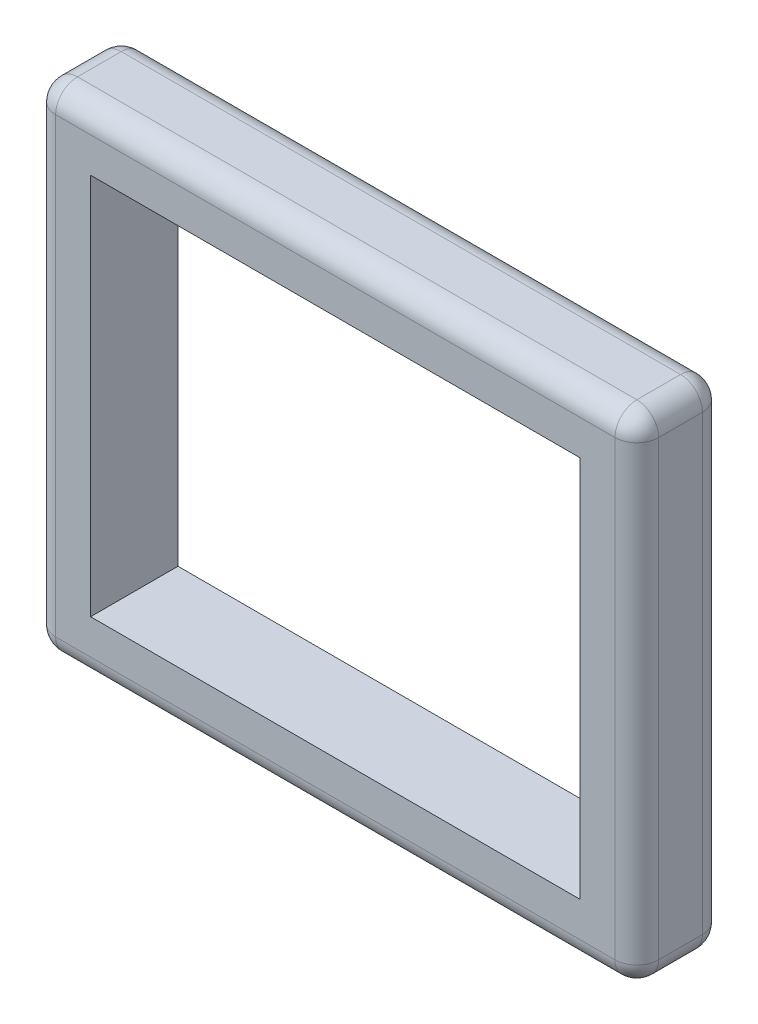
ISO-10303-21;
HEADER;
FILE_DESCRIPTION(('STEP AP214'),'2;1');
FILE_NAME('part.step','',(''),(''),'','','');
FILE_SCHEMA(('AUTOMOTIVE_DESIGN { 1 0 10303 214 1 1 1 1 }'));
ENDSEC;
DATA;
#1=APPLICATION_CONTEXT('core data for automotive mechanical design processes');
#2=APPLICATION_PROTOCOL_DEFINITION('international standard','automotive_design',2000,#1);
#3=PRODUCT_CONTEXT('',#1,'mechanical');
#4=PRODUCT('Part','Part','',(#3));
#5=PRODUCT_RELATED_PRODUCT_CATEGORY('part','',(#4));
#6=PRODUCT_DEFINITION_FORMATION('','',#4);
#7=PRODUCT_DEFINITION_CONTEXT('part definition',#1,'design');
#8=PRODUCT_DEFINITION('design','',#6,#7);
#9=PRODUCT_DEFINITION_SHAPE('','',#8);
#10=(LENGTH_UNIT() NAMED_UNIT(*) SI_UNIT(.MILLI.,.METRE.));
#11=(NAMED_UNIT(*) PLANE_ANGLE_UNIT() SI_UNIT($,.RADIAN.));
#12=(NAMED_UNIT(*) SI_UNIT($,.STERADIAN.) SOLID_ANGLE_UNIT());
#13=UNCERTAINTY_MEASURE_WITH_UNIT(LENGTH_MEASURE(1.E-05),#10,'distance_accuracy_value','');
#14=(GEOMETRIC_REPRESENTATION_CONTEXT(3) GLOBAL_UNCERTAINTY_ASSIGNED_CONTEXT((#13)) GLOBAL_UNIT_ASSIGNED_CONTEXT((#10,
#11,#12)) REPRESENTATION_CONTEXT('',''));
#15=CARTESIAN_POINT('',(0.,0.,0.));
#16=DIRECTION('',(0.,0.,1.));
#17=DIRECTION('',(1.,0.,0.));
#18=AXIS2_PLACEMENT_3D('',#15,#16,#17);
#19=CARTESIAN_POINT('',(711.2,0.,127.));
#20=DIRECTION('',(-1.,0.,0.));
#21=DIRECTION('',(0.,0.,1.));
#22=AXIS2_PLACEMENT_3D('',#19,#20,#21);
#23=PLANE('',#22);
#24=DIRECTION('',(0.,1.,0.));
#25=VECTOR('',#24,1.);
#26=CARTESIAN_POINT('',(711.2,0.,0.));
#27=LINE('',#26,#25);
#28=CARTESIAN_POINT('',(711.2,0.,0.));
#29=VERTEX_POINT('',#28);
#30=CARTESIAN_POINT('',(711.2,555.625,0.));
#31=VERTEX_POINT('',#30);
#32=EDGE_CURVE('E151',#29,#31,#27,.T.);
#33=ORIENTED_EDGE('',*,*,#32,.F.);
#34=DIRECTION('',(0.,0.,-1.));
#35=VECTOR('',#34,1.);
#36=CARTESIAN_POINT('',(711.2,0.,127.));
#37=LINE('',#36,#35);
#38=CARTESIAN_POINT('',(711.2,0.,127.));
#39=VERTEX_POINT('',#38);
#40=EDGE_CURVE('E147',#39,#29,#37,.T.);
#41=ORIENTED_EDGE('',*,*,#40,.F.);
#42=DIRECTION('',(0.,1.,0.));
#43=VECTOR('',#42,1.);
#44=CARTESIAN_POINT('',(711.2,0.,127.));
#45=LINE('',#44,#43);
#46=CARTESIAN_POINT('',(711.2,555.625,127.));
#47=VERTEX_POINT('',#46);
#48=EDGE_CURVE('E149',#39,#47,#45,.T.);
#49=ORIENTED_EDGE('',*,*,#48,.T.);
#50=DIRECTION('',(0.,0.,-1.));
#51=VECTOR('',#50,1.);
#52=CARTESIAN_POINT('',(711.2,555.625,127.));
#53=LINE('',#52,#51);
#54=EDGE_CURVE('E175',#47,#31,#53,.T.);
#55=ORIENTED_EDGE('',*,*,#54,.T.);
#56=EDGE_LOOP('',(#33,#41,#49,#55));
#57=FACE_BOUND('',#56,.T.);
#58=ADVANCED_FACE('F34',(#57),#23,.T.);
#59=CARTESIAN_POINT('',(0.,0.,127.));
#60=DIRECTION('',(0.,1.,0.));
#61=DIRECTION('',(0.,0.,1.));
#62=AXIS2_PLACEMENT_3D('',#59,#60,#61);
#63=PLANE('',#62);
#64=DIRECTION('',(1.,0.,0.));
#65=VECTOR('',#64,1.);
#66=CARTESIAN_POINT('',(0.,0.,0.));
#67=LINE('',#66,#65);
#68=CARTESIAN_POINT('',(0.,0.,0.));
#69=VERTEX_POINT('',#68);
#70=EDGE_CURVE('E177',#69,#29,#67,.T.);
#71=ORIENTED_EDGE('',*,*,#70,.F.);
#72=DIRECTION('',(0.,0.,-1.));
#73=VECTOR('',#72,1.);
#74=CARTESIAN_POINT('',(0.,0.,127.));
#75=LINE('',#74,#73);
#76=CARTESIAN_POINT('',(0.,0.,127.));
#77=VERTEX_POINT('',#76);
#78=EDGE_CURVE('E157',#77,#69,#75,.T.);
#79=ORIENTED_EDGE('',*,*,#78,.F.);
#80=DIRECTION('',(1.,0.,0.));
#81=VECTOR('',#80,1.);
#82=CARTESIAN_POINT('',(0.,0.,127.));
#83=LINE('',#82,#81);
#84=EDGE_CURVE('E163',#77,#39,#83,.T.);
#85=ORIENTED_EDGE('',*,*,#84,.T.);
#86=ORIENTED_EDGE('',*,*,#40,.T.);
#87=EDGE_LOOP('',(#71,#79,#85,#86));
#88=FACE_BOUND('',#87,.T.);
#89=ADVANCED_FACE('F168',(#88),#63,.T.);
#90=CARTESIAN_POINT('',(0.,0.,127.));
#91=DIRECTION('',(-1.,0.,0.));
#92=DIRECTION('',(0.,0.,1.));
#93=AXIS2_PLACEMENT_3D('',#90,#91,#92);
#94=PLANE('',#93);
#95=DIRECTION('',(0.,1.,0.));
#96=VECTOR('',#95,1.);
#97=CARTESIAN_POINT('',(0.,0.,0.));
#98=LINE('',#97,#96);
#99=CARTESIAN_POINT('',(0.,555.625,0.));
#100=VERTEX_POINT('',#99);
#101=EDGE_CURVE('E179',#69,#100,#98,.T.);
#102=ORIENTED_EDGE('',*,*,#101,.T.);
#103=DIRECTION('',(0.,0.,-1.));
#104=VECTOR('',#103,1.);
#105=CARTESIAN_POINT('',(0.,555.625,127.));
#106=LINE('',#105,#104);
#107=CARTESIAN_POINT('',(0.,555.625,127.));
#108=VERTEX_POINT('',#107);
#109=EDGE_CURVE('E185',#108,#100,#106,.T.);
#110=ORIENTED_EDGE('',*,*,#109,.F.);
#111=DIRECTION('',(0.,1.,0.));
#112=VECTOR('',#111,1.);
#113=CARTESIAN_POINT('',(0.,0.,127.));
#114=LINE('',#113,#112);
#115=EDGE_CURVE('E170',#77,#108,#114,.T.);
#116=ORIENTED_EDGE('',*,*,#115,.F.);
#117=ORIENTED_EDGE('',*,*,#78,.T.);
#118=EDGE_LOOP('',(#102,#110,#116,#117));
#119=FACE_BOUND('',#118,.T.);
#120=ADVANCED_FACE('F389',(#119),#94,.F.);
#121=CARTESIAN_POINT('',(793.75,1.2227125821863E-13,127.));
#122=DIRECTION('',(1.,0.,0.));
#123=DIRECTION('',(0.,1.,0.));
#124=AXIS2_PLACEMENT_3D('',#121,#122,#123);
#125=PLANE('',#124);
#126=DIRECTION('',(0.,-1.,0.));
#127=VECTOR('',#126,1.);
#128=CARTESIAN_POINT('',(793.75,638.175,31.75));
#129=LINE('',#128,#127);
#130=CARTESIAN_POINT('',(793.75,-50.8,31.75));
#131=VERTEX_POINT('',#130);
#132=CARTESIAN_POINT('',(793.75,606.425,31.75));
#133=VERTEX_POINT('',#132);
#134=EDGE_CURVE('E219',#131,#133,#129,.F.);
#135=ORIENTED_EDGE('',*,*,#134,.T.);
#136=DIRECTION('',(0.,0.,-1.));
#137=VECTOR('',#136,1.);
#138=CARTESIAN_POINT('',(793.75,606.425,127.));
#139=LINE('',#138,#137);
#140=CARTESIAN_POINT('',(793.75,606.425,95.25));
#141=VERTEX_POINT('',#140);
#142=EDGE_CURVE('E222',#133,#141,#139,.F.);
#143=ORIENTED_EDGE('',*,*,#142,.T.);
#144=DIRECTION('',(0.,-1.,0.));
#145=VECTOR('',#144,1.);
#146=CARTESIAN_POINT('',(793.75,1.2227125821863E-13,95.25));
#147=LINE('',#146,#145);
#148=CARTESIAN_POINT('',(793.75,-50.8,95.25));
#149=VERTEX_POINT('',#148);
#150=EDGE_CURVE('E217',#141,#149,#147,.T.);
#151=ORIENTED_EDGE('',*,*,#150,.T.);
#152=DIRECTION('',(0.,0.,-1.));
#153=VECTOR('',#152,1.);
#154=CARTESIAN_POINT('',(793.75,-50.8,0.));
#155=LINE('',#154,#153);
#156=EDGE_CURVE('E215',#149,#131,#155,.T.);
#157=ORIENTED_EDGE('',*,*,#156,.T.);
#158=EDGE_LOOP('',(#135,#143,#151,#157));
#159=FACE_BOUND('',#158,.T.);
#160=ADVANCED_FACE('F412',(#159),#125,.T.);
#161=CARTESIAN_POINT('',(0.,638.175,127.));
#162=DIRECTION('',(0.,1.,0.));
#163=DIRECTION('',(0.,0.,1.));
#164=AXIS2_PLACEMENT_3D('',#161,#162,#163);
#165=PLANE('',#164);
#166=DIRECTION('',(1.,0.,0.));
#167=VECTOR('',#166,1.);
#168=CARTESIAN_POINT('',(-82.55,638.175,31.75));
#169=LINE('',#168,#167);
#170=CARTESIAN_POINT('',(762.,638.175,31.75));
#171=VERTEX_POINT('',#170);
#172=CARTESIAN_POINT('',(-50.8,638.175,31.75));
#173=VERTEX_POINT('',#172);
#174=EDGE_CURVE('E201',#171,#173,#169,.F.);
#175=ORIENTED_EDGE('',*,*,#174,.T.);
#176=DIRECTION('',(0.,0.,-1.));
#177=VECTOR('',#176,1.);
#178=CARTESIAN_POINT('',(-50.8,638.175,127.));
#179=LINE('',#178,#177);
#180=CARTESIAN_POINT('',(-50.8,638.175,95.25));
#181=VERTEX_POINT('',#180);
#182=EDGE_CURVE('E204',#173,#181,#179,.F.);
#183=ORIENTED_EDGE('',*,*,#182,.T.);
#184=DIRECTION('',(1.,0.,0.));
#185=VECTOR('',#184,1.);
#186=CARTESIAN_POINT('',(0.,638.175,95.25));
#187=LINE('',#186,#185);
#188=CARTESIAN_POINT('',(762.,638.175,95.25));
#189=VERTEX_POINT('',#188);
#190=EDGE_CURVE('E199',#181,#189,#187,.T.);
#191=ORIENTED_EDGE('',*,*,#190,.T.);
#192=DIRECTION('',(0.,0.,-1.));
#193=VECTOR('',#192,1.);
#194=CARTESIAN_POINT('',(762.,638.175,127.));
#195=LINE('',#194,#193);
#196=EDGE_CURVE('E197',#189,#171,#195,.T.);
#197=ORIENTED_EDGE('',*,*,#196,.T.);
#198=EDGE_LOOP('',(#175,#183,#191,#197));
#199=FACE_BOUND('',#198,.T.);
#200=ADVANCED_FACE('F366',(#199),#165,.T.);
#201=CARTESIAN_POINT('',(-82.5499999999999,0.,127.));
#202=DIRECTION('',(1.,0.,0.));
#203=DIRECTION('',(0.,1.,0.));
#204=AXIS2_PLACEMENT_3D('',#201,#202,#203);
#205=PLANE('',#204);
#206=DIRECTION('',(0.,-1.,0.));
#207=VECTOR('',#206,1.);
#208=CARTESIAN_POINT('',(-82.55,638.175,95.25));
#209=LINE('',#208,#207);
#210=CARTESIAN_POINT('',(-82.5499999999999,-50.8,95.25));
#211=VERTEX_POINT('',#210);
#212=CARTESIAN_POINT('',(-82.55,606.425,95.25));
#213=VERTEX_POINT('',#212);
#214=EDGE_CURVE('E54',#211,#213,#209,.F.);
#215=ORIENTED_EDGE('',*,*,#214,.T.);
#216=DIRECTION('',(0.,0.,-1.));
#217=VECTOR('',#216,1.);
#218=CARTESIAN_POINT('',(-82.55,606.425,0.));
#219=LINE('',#218,#217);
#220=CARTESIAN_POINT('',(-82.55,606.425,31.75));
#221=VERTEX_POINT('',#220);
#222=EDGE_CURVE('E11',#213,#221,#219,.T.);
#223=ORIENTED_EDGE('',*,*,#222,.T.);
#224=DIRECTION('',(0.,-1.,0.));
#225=VECTOR('',#224,1.);
#226=CARTESIAN_POINT('',(-82.5499999999999,0.,31.75));
#227=LINE('',#226,#225);
#228=CARTESIAN_POINT('',(-82.5499999999999,-50.8,31.75));
#229=VERTEX_POINT('',#228);
#230=EDGE_CURVE('E43',#221,#229,#227,.T.);
#231=ORIENTED_EDGE('',*,*,#230,.T.);
#232=DIRECTION('',(0.,0.,-1.));
#233=VECTOR('',#232,1.);
#234=CARTESIAN_POINT('',(-82.5499999999999,-50.8,127.));
#235=LINE('',#234,#233);
#236=EDGE_CURVE('E233',#229,#211,#235,.F.);
#237=ORIENTED_EDGE('',*,*,#236,.T.);
#238=EDGE_LOOP('',(#215,#223,#231,#237));
#239=FACE_BOUND('',#238,.T.);
#240=ADVANCED_FACE('F332',(#239),#205,.F.);
#241=CARTESIAN_POINT('',(0.,-82.55,127.));
#242=DIRECTION('',(0.,1.,0.));
#243=DIRECTION('',(0.,0.,1.));
#244=AXIS2_PLACEMENT_3D('',#241,#242,#243);
#245=PLANE('',#244);
#246=DIRECTION('',(1.,0.,0.));
#247=VECTOR('',#246,1.);
#248=CARTESIAN_POINT('',(0.,-82.55,31.75));
#249=LINE('',#248,#247);
#250=CARTESIAN_POINT('',(-50.7999999999999,-82.55,31.75));
#251=VERTEX_POINT('',#250);
#252=CARTESIAN_POINT('',(762.,-82.55,31.75));
#253=VERTEX_POINT('',#252);
#254=EDGE_CURVE('E228',#251,#253,#249,.T.);
#255=ORIENTED_EDGE('',*,*,#254,.T.);
#256=DIRECTION('',(0.,0.,-1.));
#257=VECTOR('',#256,1.);
#258=CARTESIAN_POINT('',(762.,-82.55,127.));
#259=LINE('',#258,#257);
#260=CARTESIAN_POINT('',(762.,-82.55,95.25));
#261=VERTEX_POINT('',#260);
#262=EDGE_CURVE('E231',#253,#261,#259,.F.);
#263=ORIENTED_EDGE('',*,*,#262,.T.);
#264=DIRECTION('',(1.,0.,0.));
#265=VECTOR('',#264,1.);
#266=CARTESIAN_POINT('',(-82.5499999999999,-82.55,95.25));
#267=LINE('',#266,#265);
#268=CARTESIAN_POINT('',(-50.7999999999999,-82.55,95.25));
#269=VERTEX_POINT('',#268);
#270=EDGE_CURVE('E226',#261,#269,#267,.F.);
#271=ORIENTED_EDGE('',*,*,#270,.T.);
#272=DIRECTION('',(0.,0.,-1.));
#273=VECTOR('',#272,1.);
#274=CARTESIAN_POINT('',(-50.7999999999999,-82.55,127.));
#275=LINE('',#274,#273);
#276=EDGE_CURVE('E224',#269,#251,#275,.T.);
#277=ORIENTED_EDGE('',*,*,#276,.T.);
#278=EDGE_LOOP('',(#255,#263,#271,#277));
#279=FACE_BOUND('',#278,.T.);
#280=ADVANCED_FACE('F339',(#279),#245,.F.);
#281=CARTESIAN_POINT('',(0.,555.625,127.));
#282=DIRECTION('',(0.,1.,0.));
#283=DIRECTION('',(0.,0.,1.));
#284=AXIS2_PLACEMENT_3D('',#281,#282,#283);
#285=PLANE('',#284);
#286=DIRECTION('',(1.,0.,0.));
#287=VECTOR('',#286,1.);
#288=CARTESIAN_POINT('',(0.,555.625,0.));
#289=LINE('',#288,#287);
#290=EDGE_CURVE('E166',#100,#31,#289,.T.);
#291=ORIENTED_EDGE('',*,*,#290,.T.);
#292=ORIENTED_EDGE('',*,*,#54,.F.);
#293=DIRECTION('',(1.,0.,0.));
#294=VECTOR('',#293,1.);
#295=CARTESIAN_POINT('',(0.,555.625,127.));
#296=LINE('',#295,#294);
#297=EDGE_CURVE('E164',#108,#47,#296,.T.);
#298=ORIENTED_EDGE('',*,*,#297,.F.);
#299=ORIENTED_EDGE('',*,*,#109,.T.);
#300=EDGE_LOOP('',(#291,#292,#298,#299));
#301=FACE_BOUND('',#300,.T.);
#302=ADVANCED_FACE('F391',(#301),#285,.F.);
#303=CARTESIAN_POINT('',(0.,0.,127.));
#304=DIRECTION('',(0.,0.,1.));
#305=DIRECTION('',(1.,0.,0.));
#306=AXIS2_PLACEMENT_3D('',#303,#304,#305);
#307=PLANE('',#306);
#308=DIRECTION('',(0.,-1.,0.));
#309=VECTOR('',#308,1.);
#310=CARTESIAN_POINT('',(762.,1.17380407889884E-13,127.));
#311=LINE('',#310,#309);
#312=CARTESIAN_POINT('',(762.,-50.8,127.));
#313=VERTEX_POINT('',#312);
#314=CARTESIAN_POINT('',(762.,606.425,127.));
#315=VERTEX_POINT('',#314);
#316=EDGE_CURVE('E210',#313,#315,#311,.F.);
#317=ORIENTED_EDGE('',*,*,#316,.T.);
#318=DIRECTION('',(1.,0.,0.));
#319=VECTOR('',#318,1.);
#320=CARTESIAN_POINT('',(0.,606.425,127.));
#321=LINE('',#320,#319);
#322=CARTESIAN_POINT('',(-50.8,606.425,127.));
#323=VERTEX_POINT('',#322);
#324=EDGE_CURVE('E212',#315,#323,#321,.F.);
#325=ORIENTED_EDGE('',*,*,#324,.T.);
#326=DIRECTION('',(0.,-1.,0.));
#327=VECTOR('',#326,1.);
#328=CARTESIAN_POINT('',(-50.7999999999999,-82.55,127.));
#329=LINE('',#328,#327);
#330=CARTESIAN_POINT('',(-50.7999999999999,-50.8,127.));
#331=VERTEX_POINT('',#330);
#332=EDGE_CURVE('E206',#323,#331,#329,.T.);
#333=ORIENTED_EDGE('',*,*,#332,.T.);
#334=DIRECTION('',(1.,0.,0.));
#335=VECTOR('',#334,1.);
#336=CARTESIAN_POINT('',(793.75,-50.8,127.));
#337=LINE('',#336,#335);
#338=EDGE_CURVE('E208',#331,#313,#337,.T.);
#339=ORIENTED_EDGE('',*,*,#338,.T.);
#340=EDGE_LOOP('',(#317,#325,#333,#339));
#341=FACE_BOUND('',#340,.T.);
#342=ORIENTED_EDGE('',*,*,#48,.F.);
#343=ORIENTED_EDGE('',*,*,#84,.F.);
#344=ORIENTED_EDGE('',*,*,#115,.T.);
#345=ORIENTED_EDGE('',*,*,#297,.T.);
#346=EDGE_LOOP('',(#342,#343,#344,#345));
#347=FACE_BOUND('',#346,.T.);
#348=ADVANCED_FACE('F161',(#341,#347),#307,.T.);
#349=CARTESIAN_POINT('',(0.,0.,0.));
#350=DIRECTION('',(0.,0.,1.));
#351=DIRECTION('',(1.,0.,0.));
#352=AXIS2_PLACEMENT_3D('',#349,#350,#351);
#353=PLANE('',#352);
#354=DIRECTION('',(0.,-1.,0.));
#355=VECTOR('',#354,1.);
#356=CARTESIAN_POINT('',(-50.7999999999999,0.,0.));
#357=LINE('',#356,#355);
#358=CARTESIAN_POINT('',(-50.7999999999999,-50.8,0.));
#359=VERTEX_POINT('',#358);
#360=CARTESIAN_POINT('',(-50.8,606.425,0.));
#361=VERTEX_POINT('',#360);
#362=EDGE_CURVE('E156',#359,#361,#357,.F.);
#363=ORIENTED_EDGE('',*,*,#362,.T.);
#364=DIRECTION('',(1.,0.,0.));
#365=VECTOR('',#364,1.);
#366=CARTESIAN_POINT('',(793.75,606.425,0.));
#367=LINE('',#366,#365);
#368=CARTESIAN_POINT('',(762.,606.425,0.));
#369=VERTEX_POINT('',#368);
#370=EDGE_CURVE('E194',#361,#369,#367,.T.);
#371=ORIENTED_EDGE('',*,*,#370,.T.);
#372=DIRECTION('',(0.,-1.,0.));
#373=VECTOR('',#372,1.);
#374=CARTESIAN_POINT('',(762.,-82.55,0.));
#375=LINE('',#374,#373);
#376=CARTESIAN_POINT('',(762.,-50.8,0.));
#377=VERTEX_POINT('',#376);
#378=EDGE_CURVE('E192',#369,#377,#375,.T.);
#379=ORIENTED_EDGE('',*,*,#378,.T.);
#380=DIRECTION('',(1.,0.,0.));
#381=VECTOR('',#380,1.);
#382=CARTESIAN_POINT('',(0.,-50.8,0.));
#383=LINE('',#382,#381);
#384=EDGE_CURVE('E190',#377,#359,#383,.F.);
#385=ORIENTED_EDGE('',*,*,#384,.T.);
#386=EDGE_LOOP('',(#363,#371,#379,#385));
#387=FACE_BOUND('',#386,.T.);
#388=ORIENTED_EDGE('',*,*,#32,.T.);
#389=ORIENTED_EDGE('',*,*,#290,.F.);
#390=ORIENTED_EDGE('',*,*,#101,.F.);
#391=ORIENTED_EDGE('',*,*,#70,.T.);
#392=EDGE_LOOP('',(#388,#389,#390,#391));
#393=FACE_BOUND('',#392,.T.);
#394=ADVANCED_FACE('F382',(#387,#393),#353,.F.);
#395=CARTESIAN_POINT('',(0.,-50.8,95.25));
#396=DIRECTION('',(-1.,0.,0.));
#397=DIRECTION('',(0.,0.,1.));
#398=AXIS2_PLACEMENT_3D('',#395,#396,#397);
#399=CYLINDRICAL_SURFACE('',#398,31.75);
#400=CARTESIAN_POINT('',(-50.7999999999999,-50.8,95.25));
#401=DIRECTION('',(-1.,0.,0.));
#402=DIRECTION('',(0.,0.,1.));
#403=AXIS2_PLACEMENT_3D('',#400,#401,#402);
#404=CIRCLE('',#403,31.75);
#405=EDGE_CURVE('E38',#269,#331,#404,.T.);
#406=ORIENTED_EDGE('',*,*,#405,.F.);
#407=ORIENTED_EDGE('',*,*,#270,.F.);
#408=CARTESIAN_POINT('',(762.,-50.8,95.25));
#409=DIRECTION('',(1.,0.,0.));
#410=DIRECTION('',(0.,0.,-1.));
#411=AXIS2_PLACEMENT_3D('',#408,#409,#410);
#412=CIRCLE('',#411,31.75);
#413=EDGE_CURVE('E296',#313,#261,#412,.T.);
#414=ORIENTED_EDGE('',*,*,#413,.F.);
#415=ORIENTED_EDGE('',*,*,#338,.F.);
#416=EDGE_LOOP('',(#406,#407,#414,#415));
#417=FACE_BOUND('',#416,.T.);
#418=ADVANCED_FACE('F36',(#417),#399,.T.);
#419=CARTESIAN_POINT('',(-50.7999999999999,-50.8,95.25));
#420=DIRECTION('',(0.,0.,1.));
#421=DIRECTION('',(1.,0.,0.));
#422=AXIS2_PLACEMENT_3D('',#419,#420,#421);
#423=SPHERICAL_SURFACE('',#422,31.75);
#424=CARTESIAN_POINT('',(-50.7999999999999,-50.8,95.25));
#425=DIRECTION('',(0.,0.,1.));
#426=DIRECTION('',(1.,0.,0.));
#427=AXIS2_PLACEMENT_3D('',#424,#425,#426);
#428=CIRCLE('',#427,31.75);
#429=EDGE_CURVE('E291',#269,#211,#428,.F.);
#430=ORIENTED_EDGE('',*,*,#429,.F.);
#431=ORIENTED_EDGE('',*,*,#405,.T.);
#432=CARTESIAN_POINT('',(-50.7999999999999,-50.8,95.25));
#433=DIRECTION('',(0.,-1.,0.));
#434=DIRECTION('',(1.,0.,0.));
#435=AXIS2_PLACEMENT_3D('',#432,#433,#434);
#436=CIRCLE('',#435,31.75);
#437=EDGE_CURVE('E294',#211,#331,#436,.F.);
#438=ORIENTED_EDGE('',*,*,#437,.F.);
#439=EDGE_LOOP('',(#430,#431,#438));
#440=FACE_BOUND('',#439,.T.);
#441=ADVANCED_FACE('F307',(#440),#423,.T.);
#442=CARTESIAN_POINT('',(762.,-50.8,95.25));
#443=DIRECTION('',(0.,0.,1.));
#444=DIRECTION('',(1.,0.,0.));
#445=AXIS2_PLACEMENT_3D('',#442,#443,#444);
#446=SPHERICAL_SURFACE('',#445,31.75);
#447=CARTESIAN_POINT('',(762.,-50.8,95.25));
#448=DIRECTION('',(0.,-1.,0.));
#449=DIRECTION('',(1.,0.,0.));
#450=AXIS2_PLACEMENT_3D('',#447,#448,#449);
#451=CIRCLE('',#450,31.75);
#452=EDGE_CURVE('E285',#313,#149,#451,.F.);
#453=ORIENTED_EDGE('',*,*,#452,.F.);
#454=ORIENTED_EDGE('',*,*,#413,.T.);
#455=CARTESIAN_POINT('',(762.,-50.8,95.25));
#456=DIRECTION('',(0.,0.,1.));
#457=DIRECTION('',(1.,0.,0.));
#458=AXIS2_PLACEMENT_3D('',#455,#456,#457);
#459=CIRCLE('',#458,31.75);
#460=EDGE_CURVE('E288',#149,#261,#459,.F.);
#461=ORIENTED_EDGE('',*,*,#460,.F.);
#462=EDGE_LOOP('',(#453,#454,#461));
#463=FACE_BOUND('',#462,.T.);
#464=ADVANCED_FACE('F353',(#463),#446,.T.);
#465=CARTESIAN_POINT('',(-50.7999999999999,0.,95.25));
#466=DIRECTION('',(0.,1.,0.));
#467=DIRECTION('',(-1.,0.,0.));
#468=AXIS2_PLACEMENT_3D('',#465,#466,#467);
#469=CYLINDRICAL_SURFACE('',#468,31.75);
#470=ORIENTED_EDGE('',*,*,#437,.T.);
#471=ORIENTED_EDGE('',*,*,#332,.F.);
#472=CARTESIAN_POINT('',(-50.8,606.425,95.25));
#473=DIRECTION('',(0.,1.,0.));
#474=DIRECTION('',(0.,0.,1.));
#475=AXIS2_PLACEMENT_3D('',#472,#473,#474);
#476=CIRCLE('',#475,31.75);
#477=EDGE_CURVE('E280',#213,#323,#476,.T.);
#478=ORIENTED_EDGE('',*,*,#477,.F.);
#479=ORIENTED_EDGE('',*,*,#214,.F.);
#480=EDGE_LOOP('',(#470,#471,#478,#479));
#481=FACE_BOUND('',#480,.T.);
#482=ADVANCED_FACE('F314',(#481),#469,.T.);
#483=CARTESIAN_POINT('',(-50.7999999999999,-50.8,127.));
#484=DIRECTION('',(0.,0.,-1.));
#485=DIRECTION('',(-1.,0.,0.));
#486=AXIS2_PLACEMENT_3D('',#483,#484,#485);
#487=CYLINDRICAL_SURFACE('',#486,31.75);
#488=ORIENTED_EDGE('',*,*,#429,.T.);
#489=ORIENTED_EDGE('',*,*,#236,.F.);
#490=CARTESIAN_POINT('',(-50.7999999999999,-50.8,31.75));
#491=DIRECTION('',(0.,0.,-1.));
#492=DIRECTION('',(-1.,0.,0.));
#493=AXIS2_PLACEMENT_3D('',#490,#491,#492);
#494=CIRCLE('',#493,31.75);
#495=EDGE_CURVE('E277',#251,#229,#494,.T.);
#496=ORIENTED_EDGE('',*,*,#495,.F.);
#497=ORIENTED_EDGE('',*,*,#276,.F.);
#498=EDGE_LOOP('',(#488,#489,#496,#497));
#499=FACE_BOUND('',#498,.T.);
#500=ADVANCED_FACE('F336',(#499),#487,.T.);
#501=CARTESIAN_POINT('',(0.,-50.8,31.75));
#502=DIRECTION('',(1.,0.,0.));
#503=DIRECTION('',(0.,0.,-1.));
#504=AXIS2_PLACEMENT_3D('',#501,#502,#503);
#505=CYLINDRICAL_SURFACE('',#504,31.75);
#506=CARTESIAN_POINT('',(762.,-50.8,31.75));
#507=DIRECTION('',(1.,0.,0.));
#508=DIRECTION('',(0.,0.,-1.));
#509=AXIS2_PLACEMENT_3D('',#506,#507,#508);
#510=CIRCLE('',#509,31.75);
#511=EDGE_CURVE('E271',#253,#377,#510,.T.);
#512=ORIENTED_EDGE('',*,*,#511,.F.);
#513=ORIENTED_EDGE('',*,*,#254,.F.);
#514=CARTESIAN_POINT('',(-50.7999999999999,-50.8,31.75));
#515=DIRECTION('',(-1.,0.,0.));
#516=DIRECTION('',(0.,0.,1.));
#517=AXIS2_PLACEMENT_3D('',#514,#515,#516);
#518=CIRCLE('',#517,31.75);
#519=EDGE_CURVE('E274',#359,#251,#518,.T.);
#520=ORIENTED_EDGE('',*,*,#519,.F.);
#521=ORIENTED_EDGE('',*,*,#384,.F.);
#522=EDGE_LOOP('',(#512,#513,#520,#521));
#523=FACE_BOUND('',#522,.T.);
#524=ADVANCED_FACE('F343',(#523),#505,.T.);
#525=CARTESIAN_POINT('',(762.,-50.8,127.));
#526=DIRECTION('',(0.,0.,1.));
#527=DIRECTION('',(1.,0.,0.));
#528=AXIS2_PLACEMENT_3D('',#525,#526,#527);
#529=CYLINDRICAL_SURFACE('',#528,31.75);
#530=ORIENTED_EDGE('',*,*,#460,.T.);
#531=ORIENTED_EDGE('',*,*,#262,.F.);
#532=CARTESIAN_POINT('',(762.,-50.8,31.75));
#533=DIRECTION('',(0.,0.,-1.));
#534=DIRECTION('',(-1.,0.,0.));
#535=AXIS2_PLACEMENT_3D('',#532,#533,#534);
#536=CIRCLE('',#535,31.75);
#537=EDGE_CURVE('E269',#131,#253,#536,.T.);
#538=ORIENTED_EDGE('',*,*,#537,.F.);
#539=ORIENTED_EDGE('',*,*,#156,.F.);
#540=EDGE_LOOP('',(#530,#531,#538,#539));
#541=FACE_BOUND('',#540,.T.);
#542=ADVANCED_FACE('F350',(#541),#529,.T.);
#543=CARTESIAN_POINT('',(762.,1.17380407889884E-13,95.25));
#544=DIRECTION('',(0.,-1.,0.));
#545=DIRECTION('',(1.,0.,0.));
#546=AXIS2_PLACEMENT_3D('',#543,#544,#545);
#547=CYLINDRICAL_SURFACE('',#546,31.75);
#548=ORIENTED_EDGE('',*,*,#452,.T.);
#549=ORIENTED_EDGE('',*,*,#150,.F.);
#550=CARTESIAN_POINT('',(762.,606.425,95.25));
#551=DIRECTION('',(0.,1.,0.));
#552=DIRECTION('',(0.,0.,1.));
#553=AXIS2_PLACEMENT_3D('',#550,#551,#552);
#554=CIRCLE('',#553,31.75);
#555=EDGE_CURVE('E266',#315,#141,#554,.T.);
#556=ORIENTED_EDGE('',*,*,#555,.F.);
#557=ORIENTED_EDGE('',*,*,#316,.F.);
#558=EDGE_LOOP('',(#548,#549,#556,#557));
#559=FACE_BOUND('',#558,.T.);
#560=ADVANCED_FACE('F357',(#559),#547,.T.);
#561=CARTESIAN_POINT('',(0.,606.425,95.25));
#562=DIRECTION('',(1.,0.,0.));
#563=DIRECTION('',(0.,0.,-1.));
#564=AXIS2_PLACEMENT_3D('',#561,#562,#563);
#565=CYLINDRICAL_SURFACE('',#564,31.75);
#566=CARTESIAN_POINT('',(-50.8,606.425,95.25));
#567=DIRECTION('',(-1.,0.,0.));
#568=DIRECTION('',(0.,-1.,0.));
#569=AXIS2_PLACEMENT_3D('',#566,#567,#568);
#570=CIRCLE('',#569,31.75);
#571=EDGE_CURVE('E282',#323,#181,#570,.T.);
#572=ORIENTED_EDGE('',*,*,#571,.F.);
#573=ORIENTED_EDGE('',*,*,#324,.F.);
#574=CARTESIAN_POINT('',(762.,606.425,95.25));
#575=DIRECTION('',(1.,0.,0.));
#576=DIRECTION('',(0.,0.,-1.));
#577=AXIS2_PLACEMENT_3D('',#574,#575,#576);
#578=CIRCLE('',#577,31.75);
#579=EDGE_CURVE('E263',#189,#315,#578,.T.);
#580=ORIENTED_EDGE('',*,*,#579,.F.);
#581=ORIENTED_EDGE('',*,*,#190,.F.);
#582=EDGE_LOOP('',(#572,#573,#580,#581));
#583=FACE_BOUND('',#582,.T.);
#584=ADVANCED_FACE('F362',(#583),#565,.T.);
#585=CARTESIAN_POINT('',(-50.8,606.425,95.25));
#586=DIRECTION('',(0.,0.,1.));
#587=DIRECTION('',(1.,0.,0.));
#588=AXIS2_PLACEMENT_3D('',#585,#586,#587);
#589=SPHERICAL_SURFACE('',#588,31.75);
#590=ORIENTED_EDGE('',*,*,#477,.T.);
#591=ORIENTED_EDGE('',*,*,#571,.T.);
#592=CARTESIAN_POINT('',(-50.8,606.425,95.25));
#593=DIRECTION('',(0.,0.,1.));
#594=DIRECTION('',(1.,0.,0.));
#595=AXIS2_PLACEMENT_3D('',#592,#593,#594);
#596=CIRCLE('',#595,31.75);
#597=EDGE_CURVE('E260',#213,#181,#596,.F.);
#598=ORIENTED_EDGE('',*,*,#597,.F.);
#599=EDGE_LOOP('',(#590,#591,#598));
#600=FACE_BOUND('',#599,.T.);
#601=ADVANCED_FACE('F318',(#600),#589,.T.);
#602=CARTESIAN_POINT('',(-50.7999999999999,-50.8,31.75));
#603=DIRECTION('',(0.,0.,1.));
#604=DIRECTION('',(1.,0.,0.));
#605=AXIS2_PLACEMENT_3D('',#602,#603,#604);
#606=SPHERICAL_SURFACE('',#605,31.75);
#607=ORIENTED_EDGE('',*,*,#519,.T.);
#608=ORIENTED_EDGE('',*,*,#495,.T.);
#609=CARTESIAN_POINT('',(-50.7999999999999,-50.8,31.75));
#610=DIRECTION('',(0.,-1.,0.));
#611=DIRECTION('',(1.,0.,0.));
#612=AXIS2_PLACEMENT_3D('',#609,#610,#611);
#613=CIRCLE('',#612,31.75);
#614=EDGE_CURVE('E258',#359,#229,#613,.F.);
#615=ORIENTED_EDGE('',*,*,#614,.F.);
#616=EDGE_LOOP('',(#607,#608,#615));
#617=FACE_BOUND('',#616,.T.);
#618=ADVANCED_FACE('F439',(#617),#606,.T.);
#619=CARTESIAN_POINT('',(762.,-50.8,31.75));
#620=DIRECTION('',(0.,0.,1.));
#621=DIRECTION('',(1.,0.,0.));
#622=AXIS2_PLACEMENT_3D('',#619,#620,#621);
#623=SPHERICAL_SURFACE('',#622,31.75);
#624=ORIENTED_EDGE('',*,*,#537,.T.);
#625=ORIENTED_EDGE('',*,*,#511,.T.);
#626=CARTESIAN_POINT('',(762.,-50.8,31.75));
#627=DIRECTION('',(0.,-1.,0.));
#628=DIRECTION('',(1.,0.,0.));
#629=AXIS2_PLACEMENT_3D('',#626,#627,#628);
#630=CIRCLE('',#629,31.75);
#631=EDGE_CURVE('E255',#131,#377,#630,.F.);
#632=ORIENTED_EDGE('',*,*,#631,.F.);
#633=EDGE_LOOP('',(#624,#625,#632));
#634=FACE_BOUND('',#633,.T.);
#635=ADVANCED_FACE('F435',(#634),#623,.T.);
#636=CARTESIAN_POINT('',(762.,606.425,95.25));
#637=DIRECTION('',(0.,0.,1.));
#638=DIRECTION('',(1.,0.,0.));
#639=AXIS2_PLACEMENT_3D('',#636,#637,#638);
#640=SPHERICAL_SURFACE('',#639,31.75);
#641=ORIENTED_EDGE('',*,*,#579,.T.);
#642=ORIENTED_EDGE('',*,*,#555,.T.);
#643=CARTESIAN_POINT('',(762.,606.425,95.25));
#644=DIRECTION('',(0.,0.,1.));
#645=DIRECTION('',(1.,0.,0.));
#646=AXIS2_PLACEMENT_3D('',#643,#644,#645);
#647=CIRCLE('',#646,31.75);
#648=EDGE_CURVE('E252',#189,#141,#647,.F.);
#649=ORIENTED_EDGE('',*,*,#648,.F.);
#650=EDGE_LOOP('',(#641,#642,#649));
#651=FACE_BOUND('',#650,.T.);
#652=ADVANCED_FACE('F432',(#651),#640,.T.);
#653=CARTESIAN_POINT('',(-50.8,606.425,127.));
#654=DIRECTION('',(0.,0.,1.));
#655=DIRECTION('',(1.,0.,0.));
#656=AXIS2_PLACEMENT_3D('',#653,#654,#655);
#657=CYLINDRICAL_SURFACE('',#656,31.75);
#658=ORIENTED_EDGE('',*,*,#597,.T.);
#659=ORIENTED_EDGE('',*,*,#182,.F.);
#660=CARTESIAN_POINT('',(-50.8,606.425,31.75));
#661=DIRECTION('',(0.,0.,-1.));
#662=DIRECTION('',(-1.,0.,0.));
#663=AXIS2_PLACEMENT_3D('',#660,#661,#662);
#664=CIRCLE('',#663,31.75);
#665=EDGE_CURVE('E249',#221,#173,#664,.T.);
#666=ORIENTED_EDGE('',*,*,#665,.F.);
#667=ORIENTED_EDGE('',*,*,#222,.F.);
#668=EDGE_LOOP('',(#658,#659,#666,#667));
#669=FACE_BOUND('',#668,.T.);
#670=ADVANCED_FACE('F322',(#669),#657,.T.);
#671=CARTESIAN_POINT('',(-50.7999999999999,0.,31.75));
#672=DIRECTION('',(0.,-1.,0.));
#673=DIRECTION('',(1.,0.,0.));
#674=AXIS2_PLACEMENT_3D('',#671,#672,#673);
#675=CYLINDRICAL_SURFACE('',#674,31.75);
#676=ORIENTED_EDGE('',*,*,#614,.T.);
#677=ORIENTED_EDGE('',*,*,#230,.F.);
#678=CARTESIAN_POINT('',(-50.8,606.425,31.75));
#679=DIRECTION('',(0.,1.,0.));
#680=DIRECTION('',(0.,0.,1.));
#681=AXIS2_PLACEMENT_3D('',#678,#679,#680);
#682=CIRCLE('',#681,31.75);
#683=EDGE_CURVE('E246',#361,#221,#682,.T.);
#684=ORIENTED_EDGE('',*,*,#683,.F.);
#685=ORIENTED_EDGE('',*,*,#362,.F.);
#686=EDGE_LOOP('',(#676,#677,#684,#685));
#687=FACE_BOUND('',#686,.T.);
#688=ADVANCED_FACE('F330',(#687),#675,.T.);
#689=CARTESIAN_POINT('',(762.,1.17380407889884E-13,31.75));
#690=DIRECTION('',(0.,1.,0.));
#691=DIRECTION('',(-1.,0.,0.));
#692=AXIS2_PLACEMENT_3D('',#689,#690,#691);
#693=CYLINDRICAL_SURFACE('',#692,31.75);
#694=ORIENTED_EDGE('',*,*,#631,.T.);
#695=ORIENTED_EDGE('',*,*,#378,.F.);
#696=CARTESIAN_POINT('',(762.,606.425,31.75));
#697=DIRECTION('',(0.,1.,0.));
#698=DIRECTION('',(0.,0.,1.));
#699=AXIS2_PLACEMENT_3D('',#696,#697,#698);
#700=CIRCLE('',#699,31.75);
#701=EDGE_CURVE('E243',#133,#369,#700,.T.);
#702=ORIENTED_EDGE('',*,*,#701,.F.);
#703=ORIENTED_EDGE('',*,*,#134,.F.);
#704=EDGE_LOOP('',(#694,#695,#702,#703));
#705=FACE_BOUND('',#704,.T.);
#706=ADVANCED_FACE('F380',(#705),#693,.T.);
#707=CARTESIAN_POINT('',(762.,606.425,127.));
#708=DIRECTION('',(0.,0.,-1.));
#709=DIRECTION('',(-1.,0.,0.));
#710=AXIS2_PLACEMENT_3D('',#707,#708,#709);
#711=CYLINDRICAL_SURFACE('',#710,31.75);
#712=ORIENTED_EDGE('',*,*,#648,.T.);
#713=ORIENTED_EDGE('',*,*,#142,.F.);
#714=CARTESIAN_POINT('',(762.,606.425,31.75));
#715=DIRECTION('',(0.,0.,-1.));
#716=DIRECTION('',(-1.,0.,0.));
#717=AXIS2_PLACEMENT_3D('',#714,#715,#716);
#718=CIRCLE('',#717,31.75);
#719=EDGE_CURVE('E241',#171,#133,#718,.T.);
#720=ORIENTED_EDGE('',*,*,#719,.F.);
#721=ORIENTED_EDGE('',*,*,#196,.F.);
#722=EDGE_LOOP('',(#712,#713,#720,#721));
#723=FACE_BOUND('',#722,.T.);
#724=ADVANCED_FACE('F422',(#723),#711,.T.);
#725=CARTESIAN_POINT('',(-50.8,606.425,31.75));
#726=DIRECTION('',(0.,0.,1.));
#727=DIRECTION('',(1.,0.,0.));
#728=AXIS2_PLACEMENT_3D('',#725,#726,#727);
#729=SPHERICAL_SURFACE('',#728,31.75);
#730=ORIENTED_EDGE('',*,*,#683,.T.);
#731=ORIENTED_EDGE('',*,*,#665,.T.);
#732=CARTESIAN_POINT('',(-50.8,606.425,31.75));
#733=DIRECTION('',(-1.,0.,0.));
#734=DIRECTION('',(0.,0.,1.));
#735=AXIS2_PLACEMENT_3D('',#732,#733,#734);
#736=CIRCLE('',#735,31.75);
#737=EDGE_CURVE('E239',#361,#173,#736,.F.);
#738=ORIENTED_EDGE('',*,*,#737,.F.);
#739=EDGE_LOOP('',(#730,#731,#738));
#740=FACE_BOUND('',#739,.T.);
#741=ADVANCED_FACE('F326',(#740),#729,.T.);
#742=CARTESIAN_POINT('',(762.,606.425,31.75));
#743=DIRECTION('',(0.,0.,1.));
#744=DIRECTION('',(1.,0.,0.));
#745=AXIS2_PLACEMENT_3D('',#742,#743,#744);
#746=SPHERICAL_SURFACE('',#745,31.75);
#747=ORIENTED_EDGE('',*,*,#719,.T.);
#748=ORIENTED_EDGE('',*,*,#701,.T.);
#749=CARTESIAN_POINT('',(762.,606.425,31.75));
#750=DIRECTION('',(1.,0.,0.));
#751=DIRECTION('',(0.,0.,-1.));
#752=AXIS2_PLACEMENT_3D('',#749,#750,#751);
#753=CIRCLE('',#752,31.75);
#754=EDGE_CURVE('E237',#171,#369,#753,.F.);
#755=ORIENTED_EDGE('',*,*,#754,.F.);
#756=EDGE_LOOP('',(#747,#748,#755));
#757=FACE_BOUND('',#756,.T.);
#758=ADVANCED_FACE('F374',(#757),#746,.T.);
#759=CARTESIAN_POINT('',(0.,606.425,31.75));
#760=DIRECTION('',(-1.,0.,0.));
#761=DIRECTION('',(0.,0.,1.));
#762=AXIS2_PLACEMENT_3D('',#759,#760,#761);
#763=CYLINDRICAL_SURFACE('',#762,31.75);
#764=ORIENTED_EDGE('',*,*,#737,.T.);
#765=ORIENTED_EDGE('',*,*,#174,.F.);
#766=ORIENTED_EDGE('',*,*,#754,.T.);
#767=ORIENTED_EDGE('',*,*,#370,.F.);
#768=EDGE_LOOP('',(#764,#765,#766,#767));
#769=FACE_BOUND('',#768,.T.);
#770=ADVANCED_FACE('F372',(#769),#763,.T.);
#771=CLOSED_SHELL('',(#58,#89,#120,#160,#200,#240,#280,#302,#348,#394,#418,#441,#464,#482,#500,
#524,#542,#560,#584,#601,#618,#635,#652,#670,#688,#706,#724,#741,#758,#770));
#772=MANIFOLD_SOLID_BREP('B2',#771);
#773=ADVANCED_BREP_SHAPE_REPRESENTATION('',(#18,#772),#14);
#774=SHAPE_DEFINITION_REPRESENTATION(#9,#773);
ENDSEC;
END-ISO-10303-21;
